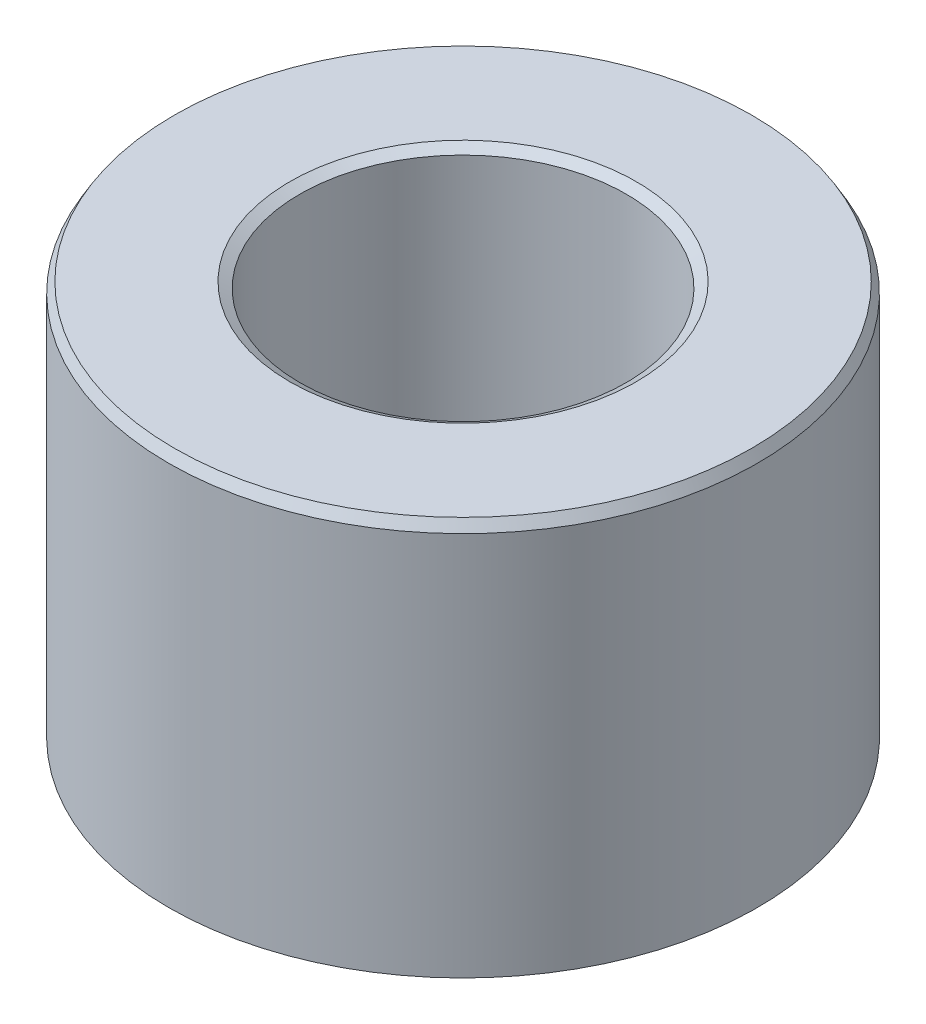
ISO-10303-21;
HEADER;
FILE_DESCRIPTION(('STEP AP214'),'2;1');
FILE_NAME('part.step','',(''),(''),'','','');
FILE_SCHEMA(('AUTOMOTIVE_DESIGN { 1 0 10303 214 1 1 1 1 }'));
ENDSEC;
DATA;
#1=APPLICATION_CONTEXT('core data for automotive mechanical design processes');
#2=APPLICATION_PROTOCOL_DEFINITION('international standard','automotive_design',2000,#1);
#3=PRODUCT_CONTEXT('',#1,'mechanical');
#4=PRODUCT('Part','Part','',(#3));
#5=PRODUCT_RELATED_PRODUCT_CATEGORY('part','',(#4));
#6=PRODUCT_DEFINITION_FORMATION('','',#4);
#7=PRODUCT_DEFINITION_CONTEXT('part definition',#1,'design');
#8=PRODUCT_DEFINITION('design','',#6,#7);
#9=PRODUCT_DEFINITION_SHAPE('','',#8);
#10=(LENGTH_UNIT() NAMED_UNIT(*) SI_UNIT(.MILLI.,.METRE.));
#11=(NAMED_UNIT(*) PLANE_ANGLE_UNIT() SI_UNIT($,.RADIAN.));
#12=(NAMED_UNIT(*) SI_UNIT($,.STERADIAN.) SOLID_ANGLE_UNIT());
#13=UNCERTAINTY_MEASURE_WITH_UNIT(LENGTH_MEASURE(1.E-05),#10,'distance_accuracy_value','');
#14=(GEOMETRIC_REPRESENTATION_CONTEXT(3) GLOBAL_UNCERTAINTY_ASSIGNED_CONTEXT((#13)) GLOBAL_UNIT_ASSIGNED_CONTEXT((#10,
#11,#12)) REPRESENTATION_CONTEXT('',''));
#15=CARTESIAN_POINT('',(0.,0.,0.));
#16=DIRECTION('',(0.,0.,1.));
#17=DIRECTION('',(1.,0.,0.));
#18=AXIS2_PLACEMENT_3D('',#15,#16,#17);
#19=CARTESIAN_POINT('',(0.,68.02980552102,0.));
#20=DIRECTION('',(0.,-1.,0.));
#21=DIRECTION('',(0.,0.,-1.));
#22=AXIS2_PLACEMENT_3D('',#19,#20,#21);
#23=CYLINDRICAL_SURFACE('',#22,50.);
#24=CARTESIAN_POINT('',(0.,0.983364027854261,0.));
#25=DIRECTION('',(0.,1.,0.));
#26=DIRECTION('',(0.,0.,1.));
#27=AXIS2_PLACEMENT_3D('',#24,#25,#26);
#28=CIRCLE('',#27,50.);
#29=CARTESIAN_POINT('',(0.,0.983364027854261,50.));
#30=VERTEX_POINT('',#29);
#31=EDGE_CURVE('E10',#30,#30,#28,.T.);
#32=ORIENTED_EDGE('',*,*,#31,.T.);
#33=EDGE_LOOP('',(#32));
#34=FACE_BOUND('',#33,.T.);
#35=CARTESIAN_POINT('',(0.,66.3265690624409,0.));
#36=DIRECTION('',(0.,1.,0.));
#37=DIRECTION('',(0.,0.,1.));
#38=AXIS2_PLACEMENT_3D('',#35,#36,#37);
#39=CIRCLE('',#38,50.);
#40=CARTESIAN_POINT('',(0.,66.3265690624409,50.));
#41=VERTEX_POINT('',#40);
#42=EDGE_CURVE('E50',#41,#41,#39,.F.);
#43=ORIENTED_EDGE('',*,*,#42,.T.);
#44=EDGE_LOOP('',(#43));
#45=FACE_BOUND('',#44,.T.);
#46=ADVANCED_FACE('F39',(#34,#45),#23,.T.);
#47=CARTESIAN_POINT('',(0.,68.02980552102,0.));
#48=DIRECTION('',(0.,1.,0.));
#49=DIRECTION('',(0.,0.,1.));
#50=AXIS2_PLACEMENT_3D('',#47,#48,#49);
#51=PLANE('',#50);
#52=CARTESIAN_POINT('',(0.,68.02980552102,0.));
#53=DIRECTION('',(0.,1.,0.));
#54=DIRECTION('',(0.,0.,1.));
#55=AXIS2_PLACEMENT_3D('',#52,#53,#54);
#56=CIRCLE('',#55,29.4310347868413);
#57=CARTESIAN_POINT('',(0.,68.02980552102,29.4310347868413));
#58=VERTEX_POINT('',#57);
#59=EDGE_CURVE('E58',#58,#58,#56,.F.);
#60=ORIENTED_EDGE('',*,*,#59,.T.);
#61=EDGE_LOOP('',(#60));
#62=FACE_BOUND('',#61,.T.);
#63=CARTESIAN_POINT('',(0.,68.02980552102,0.));
#64=DIRECTION('',(0.,1.,0.));
#65=DIRECTION('',(0.,0.,1.));
#66=AXIS2_PLACEMENT_3D('',#63,#64,#65);
#67=CIRCLE('',#66,49.0166359721458);
#68=CARTESIAN_POINT('',(0.,68.02980552102,49.0166359721458));
#69=VERTEX_POINT('',#68);
#70=EDGE_CURVE('E61',#69,#69,#67,.T.);
#71=ORIENTED_EDGE('',*,*,#70,.T.);
#72=EDGE_LOOP('',(#71));
#73=FACE_BOUND('',#72,.T.);
#74=ADVANCED_FACE('F88',(#62,#73),#51,.T.);
#75=CARTESIAN_POINT('',(0.,0.,0.));
#76=DIRECTION('',(0.,1.,0.));
#77=DIRECTION('',(0.,0.,1.));
#78=AXIS2_PLACEMENT_3D('',#75,#76,#77);
#79=PLANE('',#78);
#80=CARTESIAN_POINT('',(0.,0.,0.));
#81=DIRECTION('',(0.,1.,0.));
#82=DIRECTION('',(0.,0.,1.));
#83=AXIS2_PLACEMENT_3D('',#80,#81,#82);
#84=CIRCLE('',#83,28.7111623561164);
#85=CARTESIAN_POINT('',(0.,0.,28.7111623561164));
#86=VERTEX_POINT('',#85);
#87=EDGE_CURVE('E51',#86,#86,#84,.T.);
#88=ORIENTED_EDGE('',*,*,#87,.T.);
#89=EDGE_LOOP('',(#88));
#90=FACE_BOUND('',#89,.T.);
#91=CARTESIAN_POINT('',(0.,0.,0.));
#92=DIRECTION('',(0.,1.,0.));
#93=DIRECTION('',(0.,0.,1.));
#94=AXIS2_PLACEMENT_3D('',#91,#92,#93);
#95=CIRCLE('',#94,48.2967635414208);
#96=CARTESIAN_POINT('',(0.,0.,48.2967635414208));
#97=VERTEX_POINT('',#96);
#98=EDGE_CURVE('E54',#97,#97,#95,.F.);
#99=ORIENTED_EDGE('',*,*,#98,.T.);
#100=EDGE_LOOP('',(#99));
#101=FACE_BOUND('',#100,.T.);
#102=ADVANCED_FACE('F83',(#90,#101),#79,.F.);
#103=CARTESIAN_POINT('',(0.,68.02980552102,0.));
#104=DIRECTION('',(0.,-1.,0.));
#105=DIRECTION('',(0.,0.,-1.));
#106=AXIS2_PLACEMENT_3D('',#103,#104,#105);
#107=CYLINDRICAL_SURFACE('',#106,27.7277983282621);
#108=CARTESIAN_POINT('',(0.,67.0464414931657,0.));
#109=DIRECTION('',(0.,1.,0.));
#110=DIRECTION('',(0.,0.,1.));
#111=AXIS2_PLACEMENT_3D('',#108,#109,#110);
#112=CIRCLE('',#111,27.7277983282621);
#113=CARTESIAN_POINT('',(0.,67.0464414931657,27.7277983282621));
#114=VERTEX_POINT('',#113);
#115=EDGE_CURVE('E67',#114,#114,#112,.T.);
#116=ORIENTED_EDGE('',*,*,#115,.T.);
#117=EDGE_LOOP('',(#116));
#118=FACE_BOUND('',#117,.T.);
#119=CARTESIAN_POINT('',(0.,1.70323645857917,0.));
#120=DIRECTION('',(0.,1.,0.));
#121=DIRECTION('',(0.,0.,1.));
#122=AXIS2_PLACEMENT_3D('',#119,#120,#121);
#123=CIRCLE('',#122,27.7277983282621);
#124=CARTESIAN_POINT('',(0.,1.70323645857917,27.7277983282621));
#125=VERTEX_POINT('',#124);
#126=EDGE_CURVE('E69',#125,#125,#123,.F.);
#127=ORIENTED_EDGE('',*,*,#126,.T.);
#128=EDGE_LOOP('',(#127));
#129=FACE_BOUND('',#128,.T.);
#130=ADVANCED_FACE('F71',(#118,#129),#107,.F.);
#131=CARTESIAN_POINT('',(0.,67.0464414931657,0.));
#132=DIRECTION('',(0.,1.,0.));
#133=DIRECTION('',(0.,0.,1.));
#134=AXIS2_PLACEMENT_3D('',#131,#132,#133);
#135=CONICAL_SURFACE('',#134,27.7277983282621,1.0471975511966);
#136=ORIENTED_EDGE('',*,*,#59,.F.);
#137=EDGE_LOOP('',(#136));
#138=FACE_BOUND('',#137,.T.);
#139=ORIENTED_EDGE('',*,*,#115,.F.);
#140=EDGE_LOOP('',(#139));
#141=FACE_BOUND('',#140,.T.);
#142=ADVANCED_FACE('F77',(#138,#141),#135,.F.);
#143=CARTESIAN_POINT('',(0.,0.,0.));
#144=DIRECTION('',(0.,-1.,0.));
#145=DIRECTION('',(0.,0.,-1.));
#146=AXIS2_PLACEMENT_3D('',#143,#144,#145);
#147=CONICAL_SURFACE('',#146,28.7111623561164,0.523598775598289);
#148=ORIENTED_EDGE('',*,*,#126,.F.);
#149=EDGE_LOOP('',(#148));
#150=FACE_BOUND('',#149,.T.);
#151=ORIENTED_EDGE('',*,*,#87,.F.);
#152=EDGE_LOOP('',(#151));
#153=FACE_BOUND('',#152,.T.);
#154=ADVANCED_FACE('F73',(#150,#153),#147,.F.);
#155=CARTESIAN_POINT('',(0.,0.983364027854261,0.));
#156=DIRECTION('',(0.,1.,0.));
#157=DIRECTION('',(0.,0.,1.));
#158=AXIS2_PLACEMENT_3D('',#155,#156,#157);
#159=CONICAL_SURFACE('',#158,50.,1.0471975511966);
#160=ORIENTED_EDGE('',*,*,#98,.F.);
#161=EDGE_LOOP('',(#160));
#162=FACE_BOUND('',#161,.T.);
#163=ORIENTED_EDGE('',*,*,#31,.F.);
#164=EDGE_LOOP('',(#163));
#165=FACE_BOUND('',#164,.T.);
#166=ADVANCED_FACE('F76',(#162,#165),#159,.T.);
#167=CARTESIAN_POINT('',(0.,68.02980552102,0.));
#168=DIRECTION('',(0.,-1.,0.));
#169=DIRECTION('',(0.,0.,-1.));
#170=AXIS2_PLACEMENT_3D('',#167,#168,#169);
#171=CONICAL_SURFACE('',#170,49.0166359721458,0.523598775598291);
#172=ORIENTED_EDGE('',*,*,#42,.F.);
#173=EDGE_LOOP('',(#172));
#174=FACE_BOUND('',#173,.T.);
#175=ORIENTED_EDGE('',*,*,#70,.F.);
#176=EDGE_LOOP('',(#175));
#177=FACE_BOUND('',#176,.T.);
#178=ADVANCED_FACE('F45',(#174,#177),#171,.T.);
#179=CLOSED_SHELL('',(#46,#74,#102,#130,#142,#154,#166,#178));
#180=MANIFOLD_SOLID_BREP('B2',#179);
#181=ADVANCED_BREP_SHAPE_REPRESENTATION('',(#18,#180),#14);
#182=SHAPE_DEFINITION_REPRESENTATION(#9,#181);
ENDSEC;
END-ISO-10303-21;
